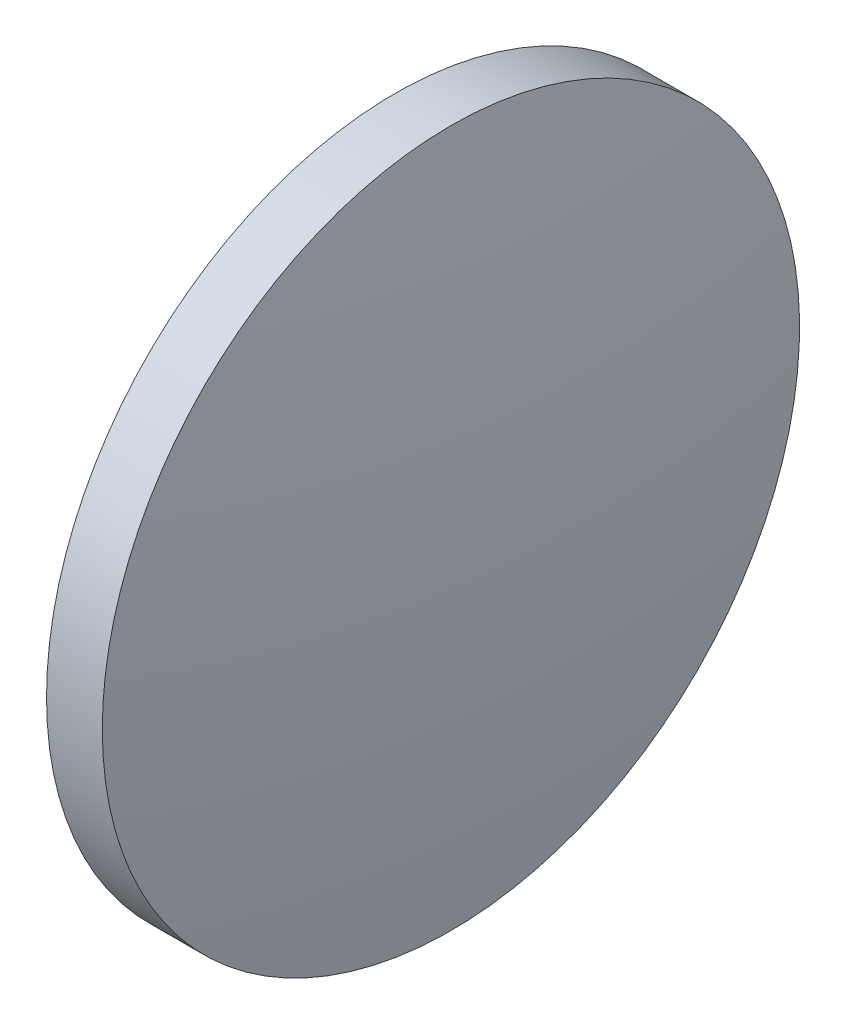
ISO-10303-21;
HEADER;
FILE_DESCRIPTION(('STEP AP214'),'2;1');
FILE_NAME('part.step','',(''),(''),'','','');
FILE_SCHEMA(('AUTOMOTIVE_DESIGN { 1 0 10303 214 1 1 1 1 }'));
ENDSEC;
DATA;
#1=APPLICATION_CONTEXT('core data for automotive mechanical design processes');
#2=APPLICATION_PROTOCOL_DEFINITION('international standard','automotive_design',2000,#1);
#3=PRODUCT_CONTEXT('',#1,'mechanical');
#4=PRODUCT('Part','Part','',(#3));
#5=PRODUCT_RELATED_PRODUCT_CATEGORY('part','',(#4));
#6=PRODUCT_DEFINITION_FORMATION('','',#4);
#7=PRODUCT_DEFINITION_CONTEXT('part definition',#1,'design');
#8=PRODUCT_DEFINITION('design','',#6,#7);
#9=PRODUCT_DEFINITION_SHAPE('','',#8);
#10=(LENGTH_UNIT() NAMED_UNIT(*) SI_UNIT(.MILLI.,.METRE.));
#11=(NAMED_UNIT(*) PLANE_ANGLE_UNIT() SI_UNIT($,.RADIAN.));
#12=(NAMED_UNIT(*) SI_UNIT($,.STERADIAN.) SOLID_ANGLE_UNIT());
#13=UNCERTAINTY_MEASURE_WITH_UNIT(LENGTH_MEASURE(1.E-05),#10,'distance_accuracy_value','');
#14=(GEOMETRIC_REPRESENTATION_CONTEXT(3) GLOBAL_UNCERTAINTY_ASSIGNED_CONTEXT((#13)) GLOBAL_UNIT_ASSIGNED_CONTEXT((#10,
#11,#12)) REPRESENTATION_CONTEXT('',''));
#15=CARTESIAN_POINT('',(0.,0.,0.));
#16=DIRECTION('',(0.,0.,1.));
#17=DIRECTION('',(1.,0.,0.));
#18=AXIS2_PLACEMENT_3D('',#15,#16,#17);
#19=CARTESIAN_POINT('',(1149.18621673891,317.435345416989,0.));
#20=DIRECTION('',(-1.,0.,0.));
#21=DIRECTION('',(0.,1.,0.));
#22=AXIS2_PLACEMENT_3D('',#19,#20,#21);
#23=SPHERICAL_SURFACE('',#22,82.7118421052631);
#24=CARTESIAN_POINT('',(1230.94805884417,317.435345416989,0.));
#25=DIRECTION('',(-1.,0.,0.));
#26=DIRECTION('',(0.,0.,1.));
#27=AXIS2_PLACEMENT_3D('',#24,#25,#26);
#28=CIRCLE('',#27,12.5);
#29=CARTESIAN_POINT('',(1230.94805884417,317.435345416989,12.5));
#30=VERTEX_POINT('',#29);
#31=EDGE_CURVE('E10',#30,#30,#28,.T.);
#32=ORIENTED_EDGE('',*,*,#31,.F.);
#33=EDGE_LOOP('',(#32));
#34=FACE_BOUND('',#33,.T.);
#35=ADVANCED_FACE('F35',(#34),#23,.T.);
#36=CARTESIAN_POINT('',(1224.20602760228,317.435345416989,0.));
#37=DIRECTION('',(-1.,0.,0.));
#38=DIRECTION('',(0.,0.,1.));
#39=AXIS2_PLACEMENT_3D('',#36,#37,#38);
#40=CYLINDRICAL_SURFACE('',#39,12.5);
#41=CARTESIAN_POINT('',(1228.94805884417,317.435345416989,0.));
#42=DIRECTION('',(-1.,0.,0.));
#43=DIRECTION('',(0.,0.,1.));
#44=AXIS2_PLACEMENT_3D('',#41,#42,#43);
#45=CIRCLE('',#44,12.5);
#46=CARTESIAN_POINT('',(1228.94805884417,317.435345416989,12.5));
#47=VERTEX_POINT('',#46);
#48=EDGE_CURVE('E41',#47,#47,#45,.T.);
#49=ORIENTED_EDGE('',*,*,#48,.F.);
#50=EDGE_LOOP('',(#49));
#51=FACE_BOUND('',#50,.T.);
#52=ORIENTED_EDGE('',*,*,#31,.T.);
#53=EDGE_LOOP('',(#52));
#54=FACE_BOUND('',#53,.T.);
#55=ADVANCED_FACE('F49',(#51,#54),#40,.T.);
#56=CARTESIAN_POINT('',(1228.94805884417,317.435345416989,0.));
#57=DIRECTION('',(1.,0.,0.));
#58=DIRECTION('',(0.,0.,-1.));
#59=AXIS2_PLACEMENT_3D('',#56,#57,#58);
#60=PLANE('',#59);
#61=ORIENTED_EDGE('',*,*,#48,.T.);
#62=EDGE_LOOP('',(#61));
#63=FACE_BOUND('',#62,.T.);
#64=ADVANCED_FACE('F47',(#63),#60,.F.);
#65=CLOSED_SHELL('',(#35,#55,#64));
#66=MANIFOLD_SOLID_BREP('B2',#65);
#67=ADVANCED_BREP_SHAPE_REPRESENTATION('',(#18,#66),#14);
#68=SHAPE_DEFINITION_REPRESENTATION(#9,#67);
ENDSEC;
END-ISO-10303-21;
